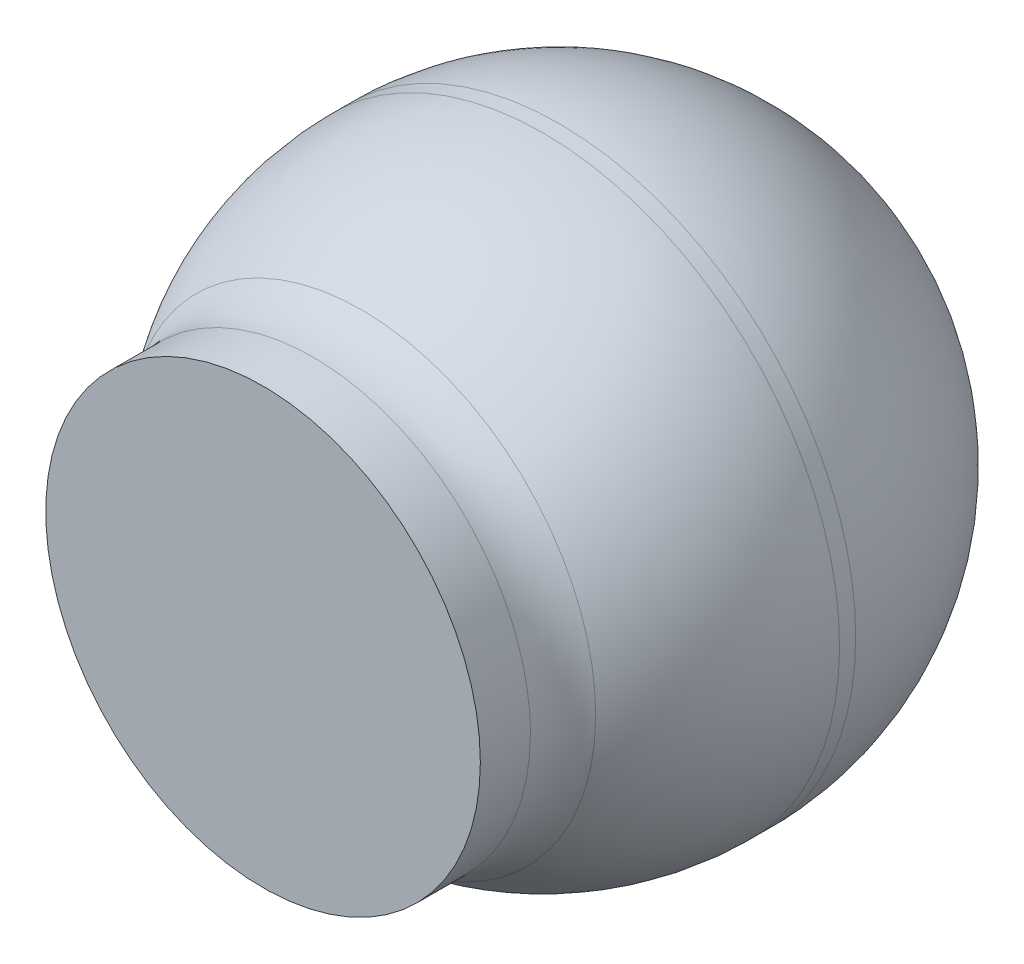
ISO-10303-21;
HEADER;
FILE_DESCRIPTION(('STEP AP214'),'2;1');
FILE_NAME('part.step','',(''),(''),'','','');
FILE_SCHEMA(('AUTOMOTIVE_DESIGN { 1 0 10303 214 1 1 1 1 }'));
ENDSEC;
DATA;
#1=APPLICATION_CONTEXT('core data for automotive mechanical design processes');
#2=APPLICATION_PROTOCOL_DEFINITION('international standard','automotive_design',2000,#1);
#3=PRODUCT_CONTEXT('',#1,'mechanical');
#4=PRODUCT('Part','Part','',(#3));
#5=PRODUCT_RELATED_PRODUCT_CATEGORY('part','',(#4));
#6=PRODUCT_DEFINITION_FORMATION('','',#4);
#7=PRODUCT_DEFINITION_CONTEXT('part definition',#1,'design');
#8=PRODUCT_DEFINITION('design','',#6,#7);
#9=PRODUCT_DEFINITION_SHAPE('','',#8);
#10=(LENGTH_UNIT() NAMED_UNIT(*) SI_UNIT(.MILLI.,.METRE.));
#11=(NAMED_UNIT(*) PLANE_ANGLE_UNIT() SI_UNIT($,.RADIAN.));
#12=(NAMED_UNIT(*) SI_UNIT($,.STERADIAN.) SOLID_ANGLE_UNIT());
#13=UNCERTAINTY_MEASURE_WITH_UNIT(LENGTH_MEASURE(1.E-05),#10,'distance_accuracy_value','');
#14=(GEOMETRIC_REPRESENTATION_CONTEXT(3) GLOBAL_UNCERTAINTY_ASSIGNED_CONTEXT((#13)) GLOBAL_UNIT_ASSIGNED_CONTEXT((#10,
#11,#12)) REPRESENTATION_CONTEXT('',''));
#15=CARTESIAN_POINT('',(0.,0.,0.));
#16=DIRECTION('',(0.,0.,1.));
#17=DIRECTION('',(1.,0.,0.));
#18=AXIS2_PLACEMENT_3D('',#15,#16,#17);
#19=CARTESIAN_POINT('',(1.977080077731,-10.40134929145,10.006534503384));
#20=DIRECTION('',(0.,0.,-1.));
#21=DIRECTION('',(-1.,0.,0.));
#22=AXIS2_PLACEMENT_3D('',#19,#20,#21);
#23=PLANE('',#22);
#24=CARTESIAN_POINT('',(1.977080077731,-10.40134929145,10.006534503384));
#25=DIRECTION('',(0.,0.,1.));
#26=DIRECTION('',(1.,0.,0.));
#27=AXIS2_PLACEMENT_3D('',#24,#25,#26);
#28=CIRCLE('',#27,0.275);
#29=CARTESIAN_POINT('',(2.252080077731,-10.40134929145,10.006534503384));
#30=VERTEX_POINT('',#29);
#31=EDGE_CURVE('E20',#30,#30,#28,.F.);
#32=ORIENTED_EDGE('',*,*,#31,.F.);
#33=EDGE_LOOP('',(#32));
#34=FACE_BOUND('',#33,.T.);
#35=ADVANCED_FACE('F17',(#34),#23,.F.);
#36=CARTESIAN_POINT('',(1.977080077731,-10.40134929145,9.906534503384));
#37=DIRECTION('',(0.,0.,1.));
#38=DIRECTION('',(1.,0.,0.));
#39=AXIS2_PLACEMENT_3D('',#36,#37,#38);
#40=CYLINDRICAL_SURFACE('',#39,0.275);
#41=CARTESIAN_POINT('',(1.977080077731,-10.40134929145,9.943180457728));
#42=DIRECTION('',(0.,0.,-1.));
#43=DIRECTION('',(0.996700902337582,0.081162252799247,0.));
#44=AXIS2_PLACEMENT_3D('',#41,#42,#43);
#45=CIRCLE('',#44,0.275);
#46=CARTESIAN_POINT('',(2.25117282587384,-10.3790296719302,9.943180457728));
#47=VERTEX_POINT('',#46);
#48=EDGE_CURVE('E66',#47,#47,#45,.F.);
#49=ORIENTED_EDGE('',*,*,#48,.T.);
#50=EDGE_LOOP('',(#49));
#51=FACE_BOUND('',#50,.T.);
#52=ORIENTED_EDGE('',*,*,#31,.T.);
#53=EDGE_LOOP('',(#52));
#54=FACE_BOUND('',#53,.T.);
#55=ADVANCED_FACE('F62',(#51,#54),#40,.T.);
#56=CARTESIAN_POINT('',(1.977080077731,-10.40134929145,9.943180457728));
#57=DIRECTION('',(0.,0.,-1.));
#58=DIRECTION('',(0.996700902337583,0.0811622527992448,0.));
#59=AXIS2_PLACEMENT_3D('',#56,#57,#58);
#60=TOROIDAL_SURFACE('',#59,0.375,0.1);
#61=ORIENTED_EDGE('',*,*,#48,.F.);
#62=EDGE_LOOP('',(#61));
#63=FACE_BOUND('',#62,.T.);
#64=CARTESIAN_POINT('',(1.977080077731,-10.40134929145,9.881744931236));
#65=DIRECTION('',(0.,0.,-1.));
#66=DIRECTION('',(-0.99670090233869,-0.0811622527856412,0.));
#67=AXIS2_PLACEMENT_3D('',#64,#65,#66);
#68=CIRCLE('',#67,0.29609704641234);
#69=CARTESIAN_POINT('',(1.681959884392,-10.42538119478,9.881744931236));
#70=VERTEX_POINT('',#69);
#71=EDGE_CURVE('E39',#70,#70,#68,.T.);
#72=ORIENTED_EDGE('',*,*,#71,.F.);
#73=EDGE_LOOP('',(#72));
#74=FACE_BOUND('',#73,.T.);
#75=ADVANCED_FACE('F57',(#63,#74),#60,.F.);
#76=CARTESIAN_POINT('',(1.603317239355,-10.43178513625,9.651976062157));
#77=CARTESIAN_POINT('',(1.603317239355,-10.43178513625,9.701461392103));
#78=CARTESIAN_POINT('',(1.611473782652,-10.43112094157,9.750947004335));
#79=CARTESIAN_POINT('',(1.627792914651,-10.42979205995,9.798626332798));
#80=CARTESIAN_POINT('',(1.651658609162,-10.42784865493,9.842699544317));
#81=CARTESIAN_POINT('',(1.681959884392,-10.42538119478,9.881744931236));
#82=(BOUNDED_CURVE() B_SPLINE_CURVE(5,(#76,#77,#78,#79,#80,#81),.UNSPECIFIED.,.F.,
.F.) B_SPLINE_CURVE_WITH_KNOTS((6,6),(0.,0.661568582165),
.UNSPECIFIED.) CURVE() GEOMETRIC_REPRESENTATION_ITEM() RATIONAL_B_SPLINE_CURVE((1.,1.,1.,1.,1.,1.)) REPRESENTATION_ITEM(''));
#83=CARTESIAN_POINT('',(1.977080077731,-10.40134929145,9.651976062157));
#84=DIRECTION('',(0.,0.,-1.));
#85=AXIS1_PLACEMENT('',#83,#84);
#86=SURFACE_OF_REVOLUTION('',#82,#85);
#87=CARTESIAN_POINT('',(1.977080077731,-10.40134929145,9.651976062157));
#88=DIRECTION('',(0.,0.,1.));
#89=DIRECTION('',(1.,0.,0.));
#90=AXIS2_PLACEMENT_3D('',#87,#88,#89);
#91=CIRCLE('',#90,0.375);
#92=CARTESIAN_POINT('',(2.352080077731,-10.40134929145,9.651976062157));
#93=VERTEX_POINT('',#92);
#94=EDGE_CURVE('E36',#93,#93,#91,.F.);
#95=ORIENTED_EDGE('',*,*,#94,.F.);
#96=EDGE_LOOP('',(#95));
#97=FACE_BOUND('',#96,.T.);
#98=ORIENTED_EDGE('',*,*,#71,.T.);
#99=EDGE_LOOP('',(#98));
#100=FACE_BOUND('',#99,.T.);
#101=ADVANCED_FACE('F53',(#97,#100),#86,.F.);
#102=CARTESIAN_POINT('',(1.977080077731,-10.40134929145,9.256534503384));
#103=DIRECTION('',(0.,0.,1.));
#104=DIRECTION('',(1.,0.,0.));
#105=AXIS2_PLACEMENT_3D('',#102,#103,#104);
#106=CYLINDRICAL_SURFACE('',#105,0.375);
#107=CARTESIAN_POINT('',(1.977080077731,-10.40134929145,9.631534503384));
#108=DIRECTION('',(0.,0.,-1.));
#109=DIRECTION('',(0.0811622527992357,-0.996700902337583,0.));
#110=AXIS2_PLACEMENT_3D('',#107,#108,#109);
#111=CIRCLE('',#110,0.375);
#112=CARTESIAN_POINT('',(2.00751592253071,-10.7751121298266,9.631534503384));
#113=VERTEX_POINT('',#112);
#114=CARTESIAN_POINT('',(1.94664423293129,-10.0275864530734,9.631534503384));
#115=VERTEX_POINT('',#114);
#116=EDGE_CURVE('E11',#113,#115,#111,.T.);
#117=ORIENTED_EDGE('',*,*,#116,.F.);
#118=CARTESIAN_POINT('',(1.977080077731,-10.40134929145,9.631534503384));
#119=DIRECTION('',(3.33436315446763E-12,2.72100352061447E-13,1.));
#120=DIRECTION('',(0.0811622527992365,-0.996700902337583,0.));
#121=AXIS2_PLACEMENT_3D('',#118,#119,#120);
#122=CIRCLE('',#121,0.375);
#123=EDGE_CURVE('E25',#115,#113,#122,.F.);
#124=ORIENTED_EDGE('',*,*,#123,.F.);
#125=EDGE_LOOP('',(#117,#124));
#126=FACE_BOUND('',#125,.T.);
#127=ORIENTED_EDGE('',*,*,#94,.T.);
#128=EDGE_LOOP('',(#127));
#129=FACE_BOUND('',#128,.T.);
#130=ADVANCED_FACE('F34',(#126,#129),#106,.T.);
#131=CARTESIAN_POINT('',(1.977080077731,-10.40134929145,9.631534503384));
#132=DIRECTION('',(0.0811622527992361,-0.996700902337583,0.));
#133=DIRECTION('',(-0.996700902337583,-0.0811622527992361,0.));
#134=AXIS2_PLACEMENT_3D('',#131,#132,#133);
#135=SPHERICAL_SURFACE('',#134,0.375);
#136=ORIENTED_EDGE('',*,*,#123,.T.);
#137=ORIENTED_EDGE('',*,*,#116,.T.);
#138=EDGE_LOOP('',(#136,#137));
#139=FACE_BOUND('',#138,.T.);
#140=ADVANCED_FACE('F32',(#139),#135,.T.);
#141=CLOSED_SHELL('',(#35,#55,#75,#101,#130,#140));
#142=MANIFOLD_SOLID_BREP('B1',#141);
#143=ADVANCED_BREP_SHAPE_REPRESENTATION('',(#18,#142),#14);
#144=SHAPE_DEFINITION_REPRESENTATION(#9,#143);
ENDSEC;
END-ISO-10303-21;
